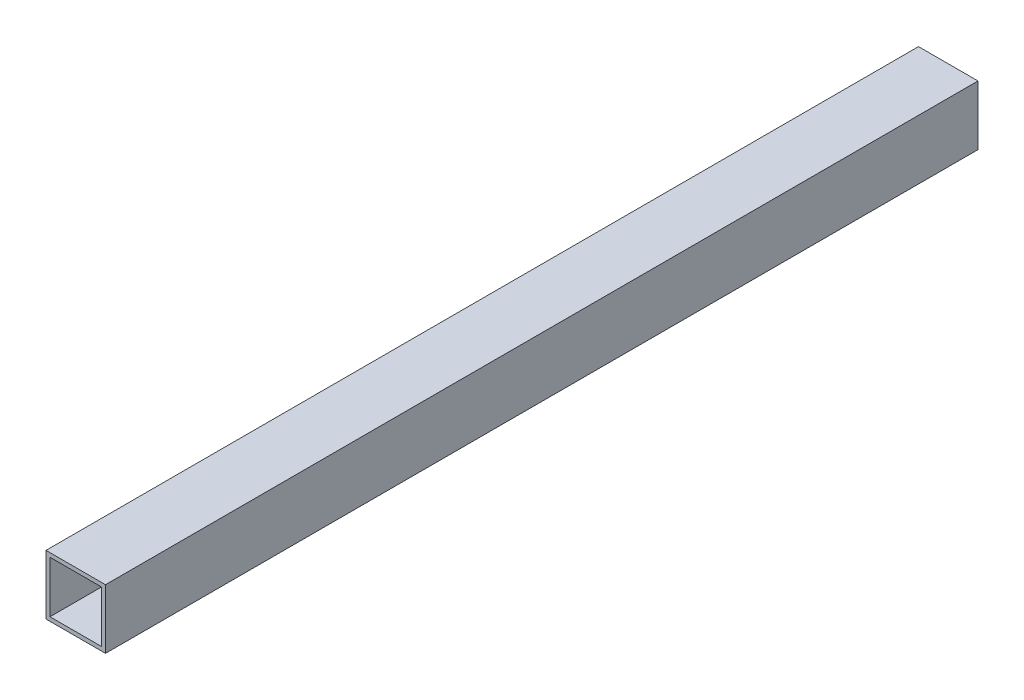
ISO-10303-21;
HEADER;
FILE_DESCRIPTION(('STEP AP214'),'2;1');
FILE_NAME('part.step','',(''),(''),'','','');
FILE_SCHEMA(('AUTOMOTIVE_DESIGN { 1 0 10303 214 1 1 1 1 }'));
ENDSEC;
DATA;
#1=APPLICATION_CONTEXT('core data for automotive mechanical design processes');
#2=APPLICATION_PROTOCOL_DEFINITION('international standard','automotive_design',2000,#1);
#3=PRODUCT_CONTEXT('',#1,'mechanical');
#4=PRODUCT('Part','Part','',(#3));
#5=PRODUCT_RELATED_PRODUCT_CATEGORY('part','',(#4));
#6=PRODUCT_DEFINITION_FORMATION('','',#4);
#7=PRODUCT_DEFINITION_CONTEXT('part definition',#1,'design');
#8=PRODUCT_DEFINITION('design','',#6,#7);
#9=PRODUCT_DEFINITION_SHAPE('','',#8);
#10=(LENGTH_UNIT() NAMED_UNIT(*) SI_UNIT(.MILLI.,.METRE.));
#11=(NAMED_UNIT(*) PLANE_ANGLE_UNIT() SI_UNIT($,.RADIAN.));
#12=(NAMED_UNIT(*) SI_UNIT($,.STERADIAN.) SOLID_ANGLE_UNIT());
#13=UNCERTAINTY_MEASURE_WITH_UNIT(LENGTH_MEASURE(1.E-05),#10,'distance_accuracy_value','');
#14=(GEOMETRIC_REPRESENTATION_CONTEXT(3) GLOBAL_UNCERTAINTY_ASSIGNED_CONTEXT((#13)) GLOBAL_UNIT_ASSIGNED_CONTEXT((#10,
#11,#12)) REPRESENTATION_CONTEXT('',''));
#15=CARTESIAN_POINT('',(0.,0.,0.));
#16=DIRECTION('',(0.,0.,1.));
#17=DIRECTION('',(1.,0.,0.));
#18=AXIS2_PLACEMENT_3D('',#15,#16,#17);
#19=CARTESIAN_POINT('',(-4.34483408803847,102.212171492546,440.));
#20=DIRECTION('',(1.,0.,0.));
#21=DIRECTION('',(0.,1.,0.));
#22=AXIS2_PLACEMENT_3D('',#19,#20,#21);
#23=PLANE('',#22);
#24=DIRECTION('',(0.,-1.,0.));
#25=VECTOR('',#24,1.);
#26=CARTESIAN_POINT('',(-4.34483408803847,102.212171492546,0.));
#27=LINE('',#26,#25);
#28=CARTESIAN_POINT('',(-4.34483408803847,102.212171492546,0.));
#29=VERTEX_POINT('',#28);
#30=CARTESIAN_POINT('',(-4.34483408803847,72.2121714925463,0.));
#31=VERTEX_POINT('',#30);
#32=EDGE_CURVE('E143',#29,#31,#27,.T.);
#33=ORIENTED_EDGE('',*,*,#32,.T.);
#34=DIRECTION('',(0.,0.,-1.));
#35=VECTOR('',#34,1.);
#36=CARTESIAN_POINT('',(-4.34483408803847,72.2121714925463,440.));
#37=LINE('',#36,#35);
#38=CARTESIAN_POINT('',(-4.34483408803847,72.2121714925463,440.));
#39=VERTEX_POINT('',#38);
#40=EDGE_CURVE('E11',#39,#31,#37,.T.);
#41=ORIENTED_EDGE('',*,*,#40,.F.);
#42=DIRECTION('',(0.,-1.,0.));
#43=VECTOR('',#42,1.);
#44=CARTESIAN_POINT('',(-4.34483408803847,102.212171492546,440.));
#45=LINE('',#44,#43);
#46=CARTESIAN_POINT('',(-4.34483408803847,102.212171492546,440.));
#47=VERTEX_POINT('',#46);
#48=EDGE_CURVE('E132',#47,#39,#45,.T.);
#49=ORIENTED_EDGE('',*,*,#48,.F.);
#50=DIRECTION('',(0.,0.,-1.));
#51=VECTOR('',#50,1.);
#52=CARTESIAN_POINT('',(-4.34483408803847,102.212171492546,440.));
#53=LINE('',#52,#51);
#54=EDGE_CURVE('E142',#47,#29,#53,.T.);
#55=ORIENTED_EDGE('',*,*,#54,.T.);
#56=EDGE_LOOP('',(#33,#41,#49,#55));
#57=FACE_BOUND('',#56,.T.);
#58=ADVANCED_FACE('F35',(#57),#23,.F.);
#59=CARTESIAN_POINT('',(-4.34483408803847,72.2121714925463,440.));
#60=DIRECTION('',(0.,1.,0.));
#61=DIRECTION('',(0.,0.,1.));
#62=AXIS2_PLACEMENT_3D('',#59,#60,#61);
#63=PLANE('',#62);
#64=DIRECTION('',(1.,0.,0.));
#65=VECTOR('',#64,1.);
#66=CARTESIAN_POINT('',(-4.34483408803847,72.2121714925463,0.));
#67=LINE('',#66,#65);
#68=CARTESIAN_POINT('',(25.6551659119615,72.2121714925463,0.));
#69=VERTEX_POINT('',#68);
#70=EDGE_CURVE('E146',#31,#69,#67,.T.);
#71=ORIENTED_EDGE('',*,*,#70,.T.);
#72=DIRECTION('',(0.,0.,-1.));
#73=VECTOR('',#72,1.);
#74=CARTESIAN_POINT('',(25.6551659119615,72.2121714925463,440.));
#75=LINE('',#74,#73);
#76=CARTESIAN_POINT('',(25.6551659119615,72.2121714925463,440.));
#77=VERTEX_POINT('',#76);
#78=EDGE_CURVE('E42',#77,#69,#75,.T.);
#79=ORIENTED_EDGE('',*,*,#78,.F.);
#80=DIRECTION('',(1.,0.,0.));
#81=VECTOR('',#80,1.);
#82=CARTESIAN_POINT('',(-4.34483408803847,72.2121714925463,440.));
#83=LINE('',#82,#81);
#84=EDGE_CURVE('E135',#39,#77,#83,.T.);
#85=ORIENTED_EDGE('',*,*,#84,.F.);
#86=ORIENTED_EDGE('',*,*,#40,.T.);
#87=EDGE_LOOP('',(#71,#79,#85,#86));
#88=FACE_BOUND('',#87,.T.);
#89=ADVANCED_FACE('F174',(#88),#63,.F.);
#90=CARTESIAN_POINT('',(25.6551659119615,102.212171492546,440.));
#91=DIRECTION('',(-1.,0.,0.));
#92=DIRECTION('',(0.,-1.,0.));
#93=AXIS2_PLACEMENT_3D('',#90,#91,#92);
#94=PLANE('',#93);
#95=DIRECTION('',(0.,1.,0.));
#96=VECTOR('',#95,1.);
#97=CARTESIAN_POINT('',(25.6551659119615,102.212171492546,0.));
#98=LINE('',#97,#96);
#99=CARTESIAN_POINT('',(25.6551659119615,102.212171492546,0.));
#100=VERTEX_POINT('',#99);
#101=EDGE_CURVE('E148',#69,#100,#98,.T.);
#102=ORIENTED_EDGE('',*,*,#101,.T.);
#103=DIRECTION('',(0.,0.,-1.));
#104=VECTOR('',#103,1.);
#105=CARTESIAN_POINT('',(25.6551659119615,102.212171492546,440.));
#106=LINE('',#105,#104);
#107=CARTESIAN_POINT('',(25.6551659119615,102.212171492546,440.));
#108=VERTEX_POINT('',#107);
#109=EDGE_CURVE('E153',#108,#100,#106,.T.);
#110=ORIENTED_EDGE('',*,*,#109,.F.);
#111=DIRECTION('',(0.,1.,0.));
#112=VECTOR('',#111,1.);
#113=CARTESIAN_POINT('',(25.6551659119615,102.212171492546,440.));
#114=LINE('',#113,#112);
#115=EDGE_CURVE('E138',#77,#108,#114,.T.);
#116=ORIENTED_EDGE('',*,*,#115,.F.);
#117=ORIENTED_EDGE('',*,*,#78,.T.);
#118=EDGE_LOOP('',(#102,#110,#116,#117));
#119=FACE_BOUND('',#118,.T.);
#120=ADVANCED_FACE('F160',(#119),#94,.F.);
#121=CARTESIAN_POINT('',(-4.34483408803847,102.212171492546,440.));
#122=DIRECTION('',(0.,-1.,0.));
#123=DIRECTION('',(0.,0.,-1.));
#124=AXIS2_PLACEMENT_3D('',#121,#122,#123);
#125=PLANE('',#124);
#126=DIRECTION('',(-1.,0.,0.));
#127=VECTOR('',#126,1.);
#128=CARTESIAN_POINT('',(-4.34483408803847,102.212171492546,0.));
#129=LINE('',#128,#127);
#130=EDGE_CURVE('E136',#100,#29,#129,.T.);
#131=ORIENTED_EDGE('',*,*,#130,.T.);
#132=ORIENTED_EDGE('',*,*,#54,.F.);
#133=DIRECTION('',(-1.,0.,0.));
#134=VECTOR('',#133,1.);
#135=CARTESIAN_POINT('',(-4.34483408803847,102.212171492546,440.));
#136=LINE('',#135,#134);
#137=EDGE_CURVE('E140',#108,#47,#136,.T.);
#138=ORIENTED_EDGE('',*,*,#137,.F.);
#139=ORIENTED_EDGE('',*,*,#109,.T.);
#140=EDGE_LOOP('',(#131,#132,#138,#139));
#141=FACE_BOUND('',#140,.T.);
#142=ADVANCED_FACE('F167',(#141),#125,.F.);
#143=CARTESIAN_POINT('',(0.,0.,440.));
#144=DIRECTION('',(0.,0.,1.));
#145=DIRECTION('',(1.,0.,0.));
#146=AXIS2_PLACEMENT_3D('',#143,#144,#145);
#147=PLANE('',#146);
#148=DIRECTION('',(0.,-1.,0.));
#149=VECTOR('',#148,1.);
#150=CARTESIAN_POINT('',(-2.34483408803847,102.212171492546,440.));
#151=LINE('',#150,#149);
#152=CARTESIAN_POINT('',(-2.34483408803847,100.212171492546,440.));
#153=VERTEX_POINT('',#152);
#154=CARTESIAN_POINT('',(-2.34483408803847,74.2121714925463,440.));
#155=VERTEX_POINT('',#154);
#156=EDGE_CURVE('E120',#153,#155,#151,.T.);
#157=ORIENTED_EDGE('',*,*,#156,.F.);
#158=DIRECTION('',(-1.,0.,0.));
#159=VECTOR('',#158,1.);
#160=CARTESIAN_POINT('',(-4.34483408803847,100.212171492546,440.));
#161=LINE('',#160,#159);
#162=CARTESIAN_POINT('',(23.6551659119615,100.212171492546,440.));
#163=VERTEX_POINT('',#162);
#164=EDGE_CURVE('E104',#163,#153,#161,.T.);
#165=ORIENTED_EDGE('',*,*,#164,.F.);
#166=DIRECTION('',(0.,1.,0.));
#167=VECTOR('',#166,1.);
#168=CARTESIAN_POINT('',(23.6551659119615,102.212171492546,440.));
#169=LINE('',#168,#167);
#170=CARTESIAN_POINT('',(23.6551659119615,74.2121714925463,440.));
#171=VERTEX_POINT('',#170);
#172=EDGE_CURVE('E129',#171,#163,#169,.T.);
#173=ORIENTED_EDGE('',*,*,#172,.F.);
#174=DIRECTION('',(1.,0.,0.));
#175=VECTOR('',#174,1.);
#176=CARTESIAN_POINT('',(-4.34483408803847,74.2121714925463,440.));
#177=LINE('',#176,#175);
#178=EDGE_CURVE('E122',#155,#171,#177,.T.);
#179=ORIENTED_EDGE('',*,*,#178,.F.);
#180=EDGE_LOOP('',(#157,#165,#173,#179));
#181=FACE_BOUND('',#180,.T.);
#182=ORIENTED_EDGE('',*,*,#48,.T.);
#183=ORIENTED_EDGE('',*,*,#84,.T.);
#184=ORIENTED_EDGE('',*,*,#115,.T.);
#185=ORIENTED_EDGE('',*,*,#137,.T.);
#186=EDGE_LOOP('',(#182,#183,#184,#185));
#187=FACE_BOUND('',#186,.T.);
#188=ADVANCED_FACE('F173',(#181,#187),#147,.T.);
#189=CARTESIAN_POINT('',(0.,0.,0.));
#190=DIRECTION('',(0.,0.,1.));
#191=DIRECTION('',(1.,0.,0.));
#192=AXIS2_PLACEMENT_3D('',#189,#190,#191);
#193=PLANE('',#192);
#194=DIRECTION('',(-1.,0.,0.));
#195=VECTOR('',#194,1.);
#196=CARTESIAN_POINT('',(-4.34483408803847,100.212171492546,0.));
#197=LINE('',#196,#195);
#198=CARTESIAN_POINT('',(23.6551659119615,100.212171492546,0.));
#199=VERTEX_POINT('',#198);
#200=CARTESIAN_POINT('',(-2.34483408803847,100.212171492546,0.));
#201=VERTEX_POINT('',#200);
#202=EDGE_CURVE('E102',#199,#201,#197,.T.);
#203=ORIENTED_EDGE('',*,*,#202,.T.);
#204=DIRECTION('',(0.,-1.,0.));
#205=VECTOR('',#204,1.);
#206=CARTESIAN_POINT('',(-2.34483408803847,102.212171492546,0.));
#207=LINE('',#206,#205);
#208=CARTESIAN_POINT('',(-2.34483408803847,74.2121714925463,0.));
#209=VERTEX_POINT('',#208);
#210=EDGE_CURVE('E110',#201,#209,#207,.T.);
#211=ORIENTED_EDGE('',*,*,#210,.T.);
#212=DIRECTION('',(1.,0.,0.));
#213=VECTOR('',#212,1.);
#214=CARTESIAN_POINT('',(-4.34483408803847,74.2121714925463,0.));
#215=LINE('',#214,#213);
#216=CARTESIAN_POINT('',(23.6551659119615,74.2121714925463,0.));
#217=VERTEX_POINT('',#216);
#218=EDGE_CURVE('E116',#209,#217,#215,.T.);
#219=ORIENTED_EDGE('',*,*,#218,.T.);
#220=DIRECTION('',(0.,1.,0.));
#221=VECTOR('',#220,1.);
#222=CARTESIAN_POINT('',(23.6551659119615,102.212171492546,0.));
#223=LINE('',#222,#221);
#224=EDGE_CURVE('E56',#217,#199,#223,.T.);
#225=ORIENTED_EDGE('',*,*,#224,.T.);
#226=EDGE_LOOP('',(#203,#211,#219,#225));
#227=FACE_BOUND('',#226,.T.);
#228=ORIENTED_EDGE('',*,*,#32,.F.);
#229=ORIENTED_EDGE('',*,*,#130,.F.);
#230=ORIENTED_EDGE('',*,*,#101,.F.);
#231=ORIENTED_EDGE('',*,*,#70,.F.);
#232=EDGE_LOOP('',(#228,#229,#230,#231));
#233=FACE_BOUND('',#232,.T.);
#234=ADVANCED_FACE('F118',(#227,#233),#193,.F.);
#235=CARTESIAN_POINT('',(-2.34483408803847,102.212171492546,440.));
#236=DIRECTION('',(1.,0.,0.));
#237=DIRECTION('',(0.,1.,0.));
#238=AXIS2_PLACEMENT_3D('',#235,#236,#237);
#239=PLANE('',#238);
#240=ORIENTED_EDGE('',*,*,#210,.F.);
#241=DIRECTION('',(0.,0.,-1.));
#242=VECTOR('',#241,1.);
#243=CARTESIAN_POINT('',(-2.34483408803847,100.212171492546,440.));
#244=LINE('',#243,#242);
#245=EDGE_CURVE('E98',#153,#201,#244,.T.);
#246=ORIENTED_EDGE('',*,*,#245,.F.);
#247=ORIENTED_EDGE('',*,*,#156,.T.);
#248=DIRECTION('',(0.,0.,-1.));
#249=VECTOR('',#248,1.);
#250=CARTESIAN_POINT('',(-2.34483408803847,74.2121714925463,440.));
#251=LINE('',#250,#249);
#252=EDGE_CURVE('E113',#155,#209,#251,.T.);
#253=ORIENTED_EDGE('',*,*,#252,.T.);
#254=EDGE_LOOP('',(#240,#246,#247,#253));
#255=FACE_BOUND('',#254,.T.);
#256=ADVANCED_FACE('F111',(#255),#239,.T.);
#257=CARTESIAN_POINT('',(-4.34483408803847,74.2121714925463,440.));
#258=DIRECTION('',(0.,1.,0.));
#259=DIRECTION('',(0.,0.,1.));
#260=AXIS2_PLACEMENT_3D('',#257,#258,#259);
#261=PLANE('',#260);
#262=ORIENTED_EDGE('',*,*,#218,.F.);
#263=ORIENTED_EDGE('',*,*,#252,.F.);
#264=ORIENTED_EDGE('',*,*,#178,.T.);
#265=DIRECTION('',(0.,0.,-1.));
#266=VECTOR('',#265,1.);
#267=CARTESIAN_POINT('',(23.6551659119615,74.2121714925463,440.));
#268=LINE('',#267,#266);
#269=EDGE_CURVE('E258',#171,#217,#268,.T.);
#270=ORIENTED_EDGE('',*,*,#269,.T.);
#271=EDGE_LOOP('',(#262,#263,#264,#270));
#272=FACE_BOUND('',#271,.T.);
#273=ADVANCED_FACE('F194',(#272),#261,.T.);
#274=CARTESIAN_POINT('',(23.6551659119615,102.212171492546,440.));
#275=DIRECTION('',(-1.,0.,0.));
#276=DIRECTION('',(0.,-1.,0.));
#277=AXIS2_PLACEMENT_3D('',#274,#275,#276);
#278=PLANE('',#277);
#279=ORIENTED_EDGE('',*,*,#224,.F.);
#280=ORIENTED_EDGE('',*,*,#269,.F.);
#281=ORIENTED_EDGE('',*,*,#172,.T.);
#282=DIRECTION('',(0.,0.,-1.));
#283=VECTOR('',#282,1.);
#284=CARTESIAN_POINT('',(23.6551659119615,100.212171492546,440.));
#285=LINE('',#284,#283);
#286=EDGE_CURVE('E49',#163,#199,#285,.T.);
#287=ORIENTED_EDGE('',*,*,#286,.T.);
#288=EDGE_LOOP('',(#279,#280,#281,#287));
#289=FACE_BOUND('',#288,.T.);
#290=ADVANCED_FACE('F191',(#289),#278,.T.);
#291=CARTESIAN_POINT('',(-4.34483408803847,100.212171492546,440.));
#292=DIRECTION('',(0.,-1.,0.));
#293=DIRECTION('',(0.,0.,-1.));
#294=AXIS2_PLACEMENT_3D('',#291,#292,#293);
#295=PLANE('',#294);
#296=ORIENTED_EDGE('',*,*,#202,.F.);
#297=ORIENTED_EDGE('',*,*,#286,.F.);
#298=ORIENTED_EDGE('',*,*,#164,.T.);
#299=ORIENTED_EDGE('',*,*,#245,.T.);
#300=EDGE_LOOP('',(#296,#297,#298,#299));
#301=FACE_BOUND('',#300,.T.);
#302=ADVANCED_FACE('F100',(#301),#295,.T.);
#303=CLOSED_SHELL('',(#58,#89,#120,#142,#188,#234,#256,#273,#290,#302));
#304=MANIFOLD_SOLID_BREP('B2',#303);
#305=ADVANCED_BREP_SHAPE_REPRESENTATION('',(#18,#304),#14);
#306=SHAPE_DEFINITION_REPRESENTATION(#9,#305);
ENDSEC;
END-ISO-10303-21;
